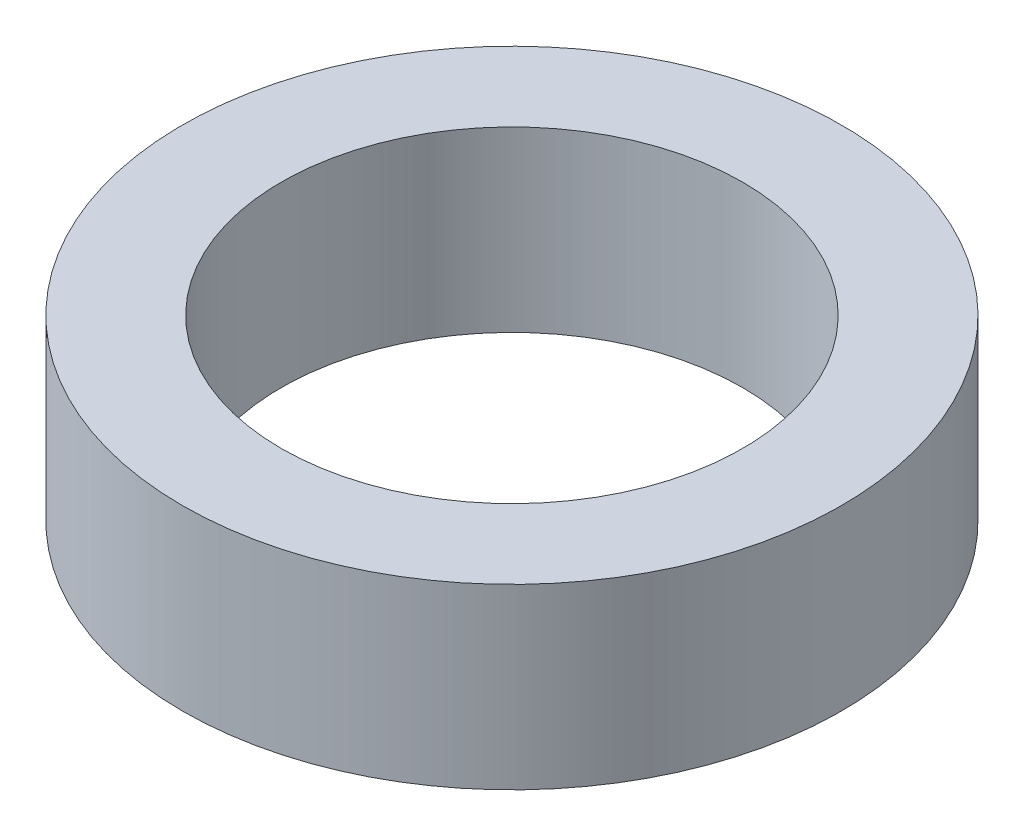
ISO-10303-21;
HEADER;
FILE_DESCRIPTION(('STEP AP214'),'2;1');
FILE_NAME('part.step','',(''),(''),'','','');
FILE_SCHEMA(('AUTOMOTIVE_DESIGN { 1 0 10303 214 1 1 1 1 }'));
ENDSEC;
DATA;
#1=APPLICATION_CONTEXT('core data for automotive mechanical design processes');
#2=APPLICATION_PROTOCOL_DEFINITION('international standard','automotive_design',2000,#1);
#3=PRODUCT_CONTEXT('',#1,'mechanical');
#4=PRODUCT('Part','Part','',(#3));
#5=PRODUCT_RELATED_PRODUCT_CATEGORY('part','',(#4));
#6=PRODUCT_DEFINITION_FORMATION('','',#4);
#7=PRODUCT_DEFINITION_CONTEXT('part definition',#1,'design');
#8=PRODUCT_DEFINITION('design','',#6,#7);
#9=PRODUCT_DEFINITION_SHAPE('','',#8);
#10=(LENGTH_UNIT() NAMED_UNIT(*) SI_UNIT(.MILLI.,.METRE.));
#11=(NAMED_UNIT(*) PLANE_ANGLE_UNIT() SI_UNIT($,.RADIAN.));
#12=(NAMED_UNIT(*) SI_UNIT($,.STERADIAN.) SOLID_ANGLE_UNIT());
#13=UNCERTAINTY_MEASURE_WITH_UNIT(LENGTH_MEASURE(1.E-05),#10,'distance_accuracy_value','');
#14=(GEOMETRIC_REPRESENTATION_CONTEXT(3) GLOBAL_UNCERTAINTY_ASSIGNED_CONTEXT((#13)) GLOBAL_UNIT_ASSIGNED_CONTEXT((#10,
#11,#12)) REPRESENTATION_CONTEXT('',''));
#15=CARTESIAN_POINT('',(0.,0.,0.));
#16=DIRECTION('',(0.,0.,1.));
#17=DIRECTION('',(1.,0.,0.));
#18=AXIS2_PLACEMENT_3D('',#15,#16,#17);
#19=CARTESIAN_POINT('',(0.,27.,0.));
#20=DIRECTION('',(0.,-1.,0.));
#21=DIRECTION('',(0.,0.,-1.));
#22=AXIS2_PLACEMENT_3D('',#19,#20,#21);
#23=CYLINDRICAL_SURFACE('',#22,50.);
#24=CARTESIAN_POINT('',(0.,27.,0.));
#25=DIRECTION('',(0.,1.,0.));
#26=DIRECTION('',(0.,0.,1.));
#27=AXIS2_PLACEMENT_3D('',#24,#25,#26);
#28=CIRCLE('',#27,50.);
#29=CARTESIAN_POINT('',(0.,27.,50.));
#30=VERTEX_POINT('',#29);
#31=EDGE_CURVE('E10',#30,#30,#28,.T.);
#32=ORIENTED_EDGE('',*,*,#31,.F.);
#33=EDGE_LOOP('',(#32));
#34=FACE_BOUND('',#33,.T.);
#35=CARTESIAN_POINT('',(0.,0.,0.));
#36=DIRECTION('',(0.,1.,0.));
#37=DIRECTION('',(0.,0.,1.));
#38=AXIS2_PLACEMENT_3D('',#35,#36,#37);
#39=CIRCLE('',#38,50.);
#40=CARTESIAN_POINT('',(0.,0.,50.));
#41=VERTEX_POINT('',#40);
#42=EDGE_CURVE('E37',#41,#41,#39,.T.);
#43=ORIENTED_EDGE('',*,*,#42,.T.);
#44=EDGE_LOOP('',(#43));
#45=FACE_BOUND('',#44,.T.);
#46=ADVANCED_FACE('F40',(#34,#45),#23,.T.);
#47=CARTESIAN_POINT('',(0.,27.,0.));
#48=DIRECTION('',(0.,1.,0.));
#49=DIRECTION('',(0.,0.,1.));
#50=AXIS2_PLACEMENT_3D('',#47,#48,#49);
#51=PLANE('',#50);
#52=CARTESIAN_POINT('',(0.,27.,0.));
#53=DIRECTION('',(0.,1.,0.));
#54=DIRECTION('',(0.,0.,1.));
#55=AXIS2_PLACEMENT_3D('',#52,#53,#54);
#56=CIRCLE('',#55,35.);
#57=CARTESIAN_POINT('',(0.,27.,35.));
#58=VERTEX_POINT('',#57);
#59=EDGE_CURVE('E50',#58,#58,#56,.T.);
#60=ORIENTED_EDGE('',*,*,#59,.F.);
#61=EDGE_LOOP('',(#60));
#62=FACE_BOUND('',#61,.T.);
#63=ORIENTED_EDGE('',*,*,#31,.T.);
#64=EDGE_LOOP('',(#63));
#65=FACE_BOUND('',#64,.T.);
#66=ADVANCED_FACE('F59',(#62,#65),#51,.T.);
#67=CARTESIAN_POINT('',(0.,0.,0.));
#68=DIRECTION('',(0.,1.,0.));
#69=DIRECTION('',(0.,0.,1.));
#70=AXIS2_PLACEMENT_3D('',#67,#68,#69);
#71=PLANE('',#70);
#72=CARTESIAN_POINT('',(0.,0.,0.));
#73=DIRECTION('',(0.,1.,0.));
#74=DIRECTION('',(0.,0.,1.));
#75=AXIS2_PLACEMENT_3D('',#72,#73,#74);
#76=CIRCLE('',#75,35.);
#77=CARTESIAN_POINT('',(0.,0.,35.));
#78=VERTEX_POINT('',#77);
#79=EDGE_CURVE('E47',#78,#78,#76,.T.);
#80=ORIENTED_EDGE('',*,*,#79,.T.);
#81=EDGE_LOOP('',(#80));
#82=FACE_BOUND('',#81,.T.);
#83=ORIENTED_EDGE('',*,*,#42,.F.);
#84=EDGE_LOOP('',(#83));
#85=FACE_BOUND('',#84,.T.);
#86=ADVANCED_FACE('F58',(#82,#85),#71,.F.);
#87=CARTESIAN_POINT('',(0.,27.,0.));
#88=DIRECTION('',(0.,-1.,0.));
#89=DIRECTION('',(0.,0.,-1.));
#90=AXIS2_PLACEMENT_3D('',#87,#88,#89);
#91=CYLINDRICAL_SURFACE('',#90,35.);
#92=ORIENTED_EDGE('',*,*,#59,.T.);
#93=EDGE_LOOP('',(#92));
#94=FACE_BOUND('',#93,.T.);
#95=ORIENTED_EDGE('',*,*,#79,.F.);
#96=EDGE_LOOP('',(#95));
#97=FACE_BOUND('',#96,.T.);
#98=ADVANCED_FACE('F54',(#94,#97),#91,.F.);
#99=CLOSED_SHELL('',(#46,#66,#86,#98));
#100=MANIFOLD_SOLID_BREP('B2',#99);
#101=ADVANCED_BREP_SHAPE_REPRESENTATION('',(#18,#100),#14);
#102=SHAPE_DEFINITION_REPRESENTATION(#9,#101);
ENDSEC;
END-ISO-10303-21;
